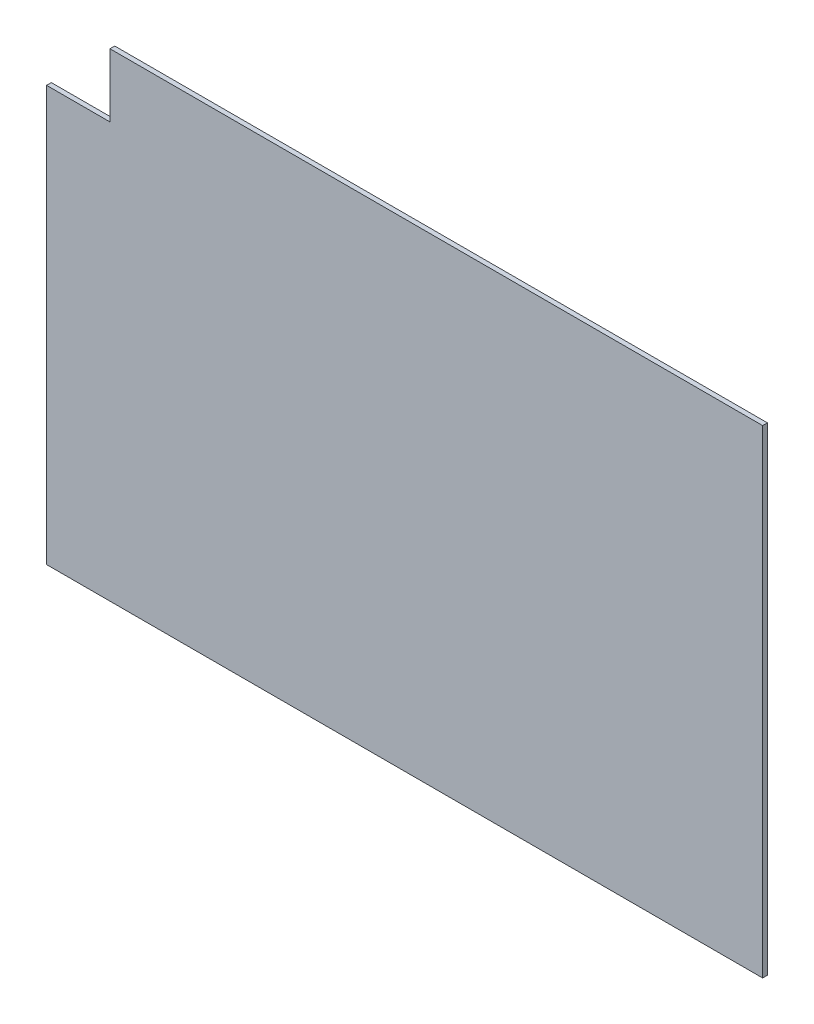
ISO-10303-21;
HEADER;
FILE_DESCRIPTION(('STEP AP214'),'2;1');
FILE_NAME('part.step','',(''),(''),'','','');
FILE_SCHEMA(('AUTOMOTIVE_DESIGN { 1 0 10303 214 1 1 1 1 }'));
ENDSEC;
DATA;
#1=APPLICATION_CONTEXT('core data for automotive mechanical design processes');
#2=APPLICATION_PROTOCOL_DEFINITION('international standard','automotive_design',2000,#1);
#3=PRODUCT_CONTEXT('',#1,'mechanical');
#4=PRODUCT('Part','Part','',(#3));
#5=PRODUCT_RELATED_PRODUCT_CATEGORY('part','',(#4));
#6=PRODUCT_DEFINITION_FORMATION('','',#4);
#7=PRODUCT_DEFINITION_CONTEXT('part definition',#1,'design');
#8=PRODUCT_DEFINITION('design','',#6,#7);
#9=PRODUCT_DEFINITION_SHAPE('','',#8);
#10=(LENGTH_UNIT() NAMED_UNIT(*) SI_UNIT(.MILLI.,.METRE.));
#11=(NAMED_UNIT(*) PLANE_ANGLE_UNIT() SI_UNIT($,.RADIAN.));
#12=(NAMED_UNIT(*) SI_UNIT($,.STERADIAN.) SOLID_ANGLE_UNIT());
#13=UNCERTAINTY_MEASURE_WITH_UNIT(LENGTH_MEASURE(1.E-05),#10,'distance_accuracy_value','');
#14=(GEOMETRIC_REPRESENTATION_CONTEXT(3) GLOBAL_UNCERTAINTY_ASSIGNED_CONTEXT((#13)) GLOBAL_UNIT_ASSIGNED_CONTEXT((#10,
#11,#12)) REPRESENTATION_CONTEXT('',''));
#15=CARTESIAN_POINT('',(0.,0.,0.));
#16=DIRECTION('',(0.,0.,1.));
#17=DIRECTION('',(1.,0.,0.));
#18=AXIS2_PLACEMENT_3D('',#15,#16,#17);
#19=CARTESIAN_POINT('',(-186.,-1.29063426612674E-13,1.5));
#20=DIRECTION('',(-1.,0.,0.));
#21=DIRECTION('',(0.,-1.,0.));
#22=AXIS2_PLACEMENT_3D('',#19,#20,#21);
#23=PLANE('',#22);
#24=DIRECTION('',(0.,1.,0.));
#25=VECTOR('',#24,1.);
#26=CARTESIAN_POINT('',(-186.,-1.29063426612674E-13,-1.5));
#27=LINE('',#26,#25);
#28=CARTESIAN_POINT('',(-186.,109.923812784271,-1.5));
#29=VERTEX_POINT('',#28);
#30=CARTESIAN_POINT('',(-186.,149.923812784272,-1.5));
#31=VERTEX_POINT('',#30);
#32=EDGE_CURVE('E116',#29,#31,#27,.T.);
#33=ORIENTED_EDGE('',*,*,#32,.F.);
#34=DIRECTION('',(0.,0.,-1.));
#35=VECTOR('',#34,1.);
#36=CARTESIAN_POINT('',(-186.,109.923812784271,1.5));
#37=LINE('',#36,#35);
#38=CARTESIAN_POINT('',(-186.,109.923812784271,1.5));
#39=VERTEX_POINT('',#38);
#40=EDGE_CURVE('E11',#39,#29,#37,.T.);
#41=ORIENTED_EDGE('',*,*,#40,.F.);
#42=DIRECTION('',(0.,1.,0.));
#43=VECTOR('',#42,1.);
#44=CARTESIAN_POINT('',(-186.,-1.29063426612674E-13,1.5));
#45=LINE('',#44,#43);
#46=CARTESIAN_POINT('',(-186.,149.923812784272,1.5));
#47=VERTEX_POINT('',#46);
#48=EDGE_CURVE('E130',#39,#47,#45,.T.);
#49=ORIENTED_EDGE('',*,*,#48,.T.);
#50=DIRECTION('',(0.,0.,-1.));
#51=VECTOR('',#50,1.);
#52=CARTESIAN_POINT('',(-186.,149.923812784272,1.5));
#53=LINE('',#52,#51);
#54=EDGE_CURVE('E51',#47,#31,#53,.T.);
#55=ORIENTED_EDGE('',*,*,#54,.T.);
#56=EDGE_LOOP('',(#33,#41,#49,#55));
#57=FACE_BOUND('',#56,.T.);
#58=ADVANCED_FACE('F35',(#57),#23,.T.);
#59=CARTESIAN_POINT('',(0.,109.923812784271,1.5));
#60=DIRECTION('',(0.,1.,0.));
#61=DIRECTION('',(0.,0.,1.));
#62=AXIS2_PLACEMENT_3D('',#59,#60,#61);
#63=PLANE('',#62);
#64=DIRECTION('',(1.,0.,0.));
#65=VECTOR('',#64,1.);
#66=CARTESIAN_POINT('',(0.,109.923812784271,-1.5));
#67=LINE('',#66,#65);
#68=CARTESIAN_POINT('',(-226.,109.923812784271,-1.5));
#69=VERTEX_POINT('',#68);
#70=EDGE_CURVE('E118',#69,#29,#67,.T.);
#71=ORIENTED_EDGE('',*,*,#70,.F.);
#72=DIRECTION('',(0.,0.,-1.));
#73=VECTOR('',#72,1.);
#74=CARTESIAN_POINT('',(-226.,109.923812784271,1.5));
#75=LINE('',#74,#73);
#76=CARTESIAN_POINT('',(-226.,109.923812784271,1.5));
#77=VERTEX_POINT('',#76);
#78=EDGE_CURVE('E43',#77,#69,#75,.T.);
#79=ORIENTED_EDGE('',*,*,#78,.F.);
#80=DIRECTION('',(1.,0.,0.));
#81=VECTOR('',#80,1.);
#82=CARTESIAN_POINT('',(0.,109.923812784271,1.5));
#83=LINE('',#82,#81);
#84=EDGE_CURVE('E205',#77,#39,#83,.T.);
#85=ORIENTED_EDGE('',*,*,#84,.T.);
#86=ORIENTED_EDGE('',*,*,#40,.T.);
#87=EDGE_LOOP('',(#71,#79,#85,#86));
#88=FACE_BOUND('',#87,.T.);
#89=ADVANCED_FACE('F139',(#88),#63,.T.);
#90=CARTESIAN_POINT('',(-226.,0.,1.5));
#91=DIRECTION('',(-1.,0.,0.));
#92=DIRECTION('',(0.,-1.,0.));
#93=AXIS2_PLACEMENT_3D('',#90,#91,#92);
#94=PLANE('',#93);
#95=DIRECTION('',(0.,1.,0.));
#96=VECTOR('',#95,1.);
#97=CARTESIAN_POINT('',(-226.,0.,-1.5));
#98=LINE('',#97,#96);
#99=CARTESIAN_POINT('',(-226.,-152.076187215728,-1.5));
#100=VERTEX_POINT('',#99);
#101=EDGE_CURVE('E121',#100,#69,#98,.T.);
#102=ORIENTED_EDGE('',*,*,#101,.F.);
#103=DIRECTION('',(0.,0.,-1.));
#104=VECTOR('',#103,1.);
#105=CARTESIAN_POINT('',(-226.,-152.076187215728,1.5));
#106=LINE('',#105,#104);
#107=CARTESIAN_POINT('',(-226.,-152.076187215728,1.5));
#108=VERTEX_POINT('',#107);
#109=EDGE_CURVE('E108',#108,#100,#106,.T.);
#110=ORIENTED_EDGE('',*,*,#109,.F.);
#111=DIRECTION('',(0.,1.,0.));
#112=VECTOR('',#111,1.);
#113=CARTESIAN_POINT('',(-226.,0.,1.5));
#114=LINE('',#113,#112);
#115=EDGE_CURVE('E98',#108,#77,#114,.T.);
#116=ORIENTED_EDGE('',*,*,#115,.T.);
#117=ORIENTED_EDGE('',*,*,#78,.T.);
#118=EDGE_LOOP('',(#102,#110,#116,#117));
#119=FACE_BOUND('',#118,.T.);
#120=ADVANCED_FACE('F136',(#119),#94,.T.);
#121=CARTESIAN_POINT('',(0.,-152.076187215728,1.5));
#122=DIRECTION('',(0.,1.,0.));
#123=DIRECTION('',(0.,0.,1.));
#124=AXIS2_PLACEMENT_3D('',#121,#122,#123);
#125=PLANE('',#124);
#126=DIRECTION('',(1.,0.,0.));
#127=VECTOR('',#126,1.);
#128=CARTESIAN_POINT('',(0.,-152.076187215728,-1.5));
#129=LINE('',#128,#127);
#130=CARTESIAN_POINT('',(226.,-152.076187215728,-1.5));
#131=VERTEX_POINT('',#130);
#132=EDGE_CURVE('E105',#100,#131,#129,.T.);
#133=ORIENTED_EDGE('',*,*,#132,.T.);
#134=DIRECTION('',(0.,0.,-1.));
#135=VECTOR('',#134,1.);
#136=CARTESIAN_POINT('',(226.,-152.076187215728,1.5));
#137=LINE('',#136,#135);
#138=CARTESIAN_POINT('',(226.,-152.076187215728,1.5));
#139=VERTEX_POINT('',#138);
#140=EDGE_CURVE('E102',#139,#131,#137,.T.);
#141=ORIENTED_EDGE('',*,*,#140,.F.);
#142=DIRECTION('',(1.,0.,0.));
#143=VECTOR('',#142,1.);
#144=CARTESIAN_POINT('',(0.,-152.076187215728,1.5));
#145=LINE('',#144,#143);
#146=EDGE_CURVE('E90',#108,#139,#145,.T.);
#147=ORIENTED_EDGE('',*,*,#146,.F.);
#148=ORIENTED_EDGE('',*,*,#109,.T.);
#149=EDGE_LOOP('',(#133,#141,#147,#148));
#150=FACE_BOUND('',#149,.T.);
#151=ADVANCED_FACE('F103',(#150),#125,.F.);
#152=CARTESIAN_POINT('',(226.,0.,1.5));
#153=DIRECTION('',(-1.,0.,0.));
#154=DIRECTION('',(0.,-1.,0.));
#155=AXIS2_PLACEMENT_3D('',#152,#153,#154);
#156=PLANE('',#155);
#157=DIRECTION('',(0.,1.,0.));
#158=VECTOR('',#157,1.);
#159=CARTESIAN_POINT('',(226.,0.,-1.5));
#160=LINE('',#159,#158);
#161=CARTESIAN_POINT('',(226.,149.923812784272,-1.5));
#162=VERTEX_POINT('',#161);
#163=EDGE_CURVE('E125',#131,#162,#160,.T.);
#164=ORIENTED_EDGE('',*,*,#163,.T.);
#165=DIRECTION('',(0.,0.,-1.));
#166=VECTOR('',#165,1.);
#167=CARTESIAN_POINT('',(226.,149.923812784272,1.5));
#168=LINE('',#167,#166);
#169=CARTESIAN_POINT('',(226.,149.923812784272,1.5));
#170=VERTEX_POINT('',#169);
#171=EDGE_CURVE('E71',#170,#162,#168,.T.);
#172=ORIENTED_EDGE('',*,*,#171,.F.);
#173=DIRECTION('',(0.,1.,0.));
#174=VECTOR('',#173,1.);
#175=CARTESIAN_POINT('',(226.,0.,1.5));
#176=LINE('',#175,#174);
#177=EDGE_CURVE('E95',#139,#170,#176,.T.);
#178=ORIENTED_EDGE('',*,*,#177,.F.);
#179=ORIENTED_EDGE('',*,*,#140,.T.);
#180=EDGE_LOOP('',(#164,#172,#178,#179));
#181=FACE_BOUND('',#180,.T.);
#182=ADVANCED_FACE('F110',(#181),#156,.F.);
#183=CARTESIAN_POINT('',(0.,149.923812784272,1.5));
#184=DIRECTION('',(0.,1.,0.));
#185=DIRECTION('',(0.,0.,1.));
#186=AXIS2_PLACEMENT_3D('',#183,#184,#185);
#187=PLANE('',#186);
#188=DIRECTION('',(1.,0.,0.));
#189=VECTOR('',#188,1.);
#190=CARTESIAN_POINT('',(0.,149.923812784272,-1.5));
#191=LINE('',#190,#189);
#192=EDGE_CURVE('E127',#31,#162,#191,.T.);
#193=ORIENTED_EDGE('',*,*,#192,.F.);
#194=ORIENTED_EDGE('',*,*,#54,.F.);
#195=DIRECTION('',(1.,0.,0.));
#196=VECTOR('',#195,1.);
#197=CARTESIAN_POINT('',(0.,149.923812784272,1.5));
#198=LINE('',#197,#196);
#199=EDGE_CURVE('E111',#47,#170,#198,.T.);
#200=ORIENTED_EDGE('',*,*,#199,.T.);
#201=ORIENTED_EDGE('',*,*,#171,.T.);
#202=EDGE_LOOP('',(#193,#194,#200,#201));
#203=FACE_BOUND('',#202,.T.);
#204=ADVANCED_FACE('F142',(#203),#187,.T.);
#205=CARTESIAN_POINT('',(0.,0.,1.5));
#206=DIRECTION('',(0.,0.,1.));
#207=DIRECTION('',(1.,0.,0.));
#208=AXIS2_PLACEMENT_3D('',#205,#206,#207);
#209=PLANE('',#208);
#210=ORIENTED_EDGE('',*,*,#48,.F.);
#211=ORIENTED_EDGE('',*,*,#84,.F.);
#212=ORIENTED_EDGE('',*,*,#115,.F.);
#213=ORIENTED_EDGE('',*,*,#146,.T.);
#214=ORIENTED_EDGE('',*,*,#177,.T.);
#215=ORIENTED_EDGE('',*,*,#199,.F.);
#216=EDGE_LOOP('',(#210,#211,#212,#213,#214,#215));
#217=FACE_BOUND('',#216,.T.);
#218=ADVANCED_FACE('F92',(#217),#209,.T.);
#219=CARTESIAN_POINT('',(0.,0.,-1.5));
#220=DIRECTION('',(0.,0.,1.));
#221=DIRECTION('',(1.,0.,0.));
#222=AXIS2_PLACEMENT_3D('',#219,#220,#221);
#223=PLANE('',#222);
#224=ORIENTED_EDGE('',*,*,#32,.T.);
#225=ORIENTED_EDGE('',*,*,#192,.T.);
#226=ORIENTED_EDGE('',*,*,#163,.F.);
#227=ORIENTED_EDGE('',*,*,#132,.F.);
#228=ORIENTED_EDGE('',*,*,#101,.T.);
#229=ORIENTED_EDGE('',*,*,#70,.T.);
#230=EDGE_LOOP('',(#224,#225,#226,#227,#228,#229));
#231=FACE_BOUND('',#230,.T.);
#232=ADVANCED_FACE('F141',(#231),#223,.F.);
#233=CLOSED_SHELL('',(#58,#89,#120,#151,#182,#204,#218,#232));
#234=MANIFOLD_SOLID_BREP('B2',#233);
#235=ADVANCED_BREP_SHAPE_REPRESENTATION('',(#18,#234),#14);
#236=SHAPE_DEFINITION_REPRESENTATION(#9,#235);
ENDSEC;
END-ISO-10303-21;
